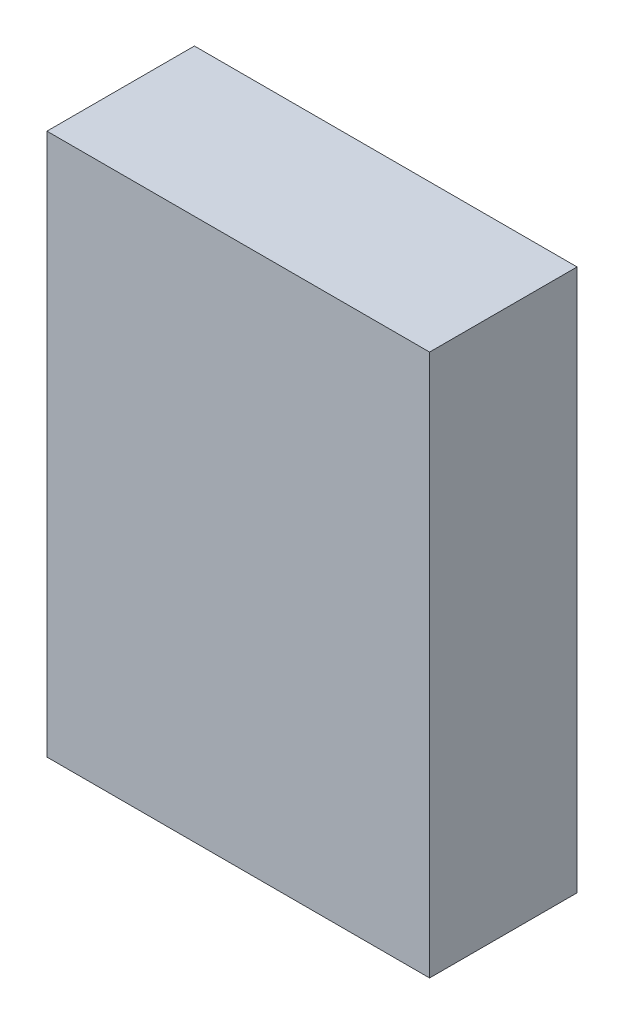
ISO-10303-21;
HEADER;
FILE_DESCRIPTION(('STEP AP214'),'2;1');
FILE_NAME('part.step','',(''),(''),'','','');
FILE_SCHEMA(('AUTOMOTIVE_DESIGN { 1 0 10303 214 1 1 1 1 }'));
ENDSEC;
DATA;
#1=APPLICATION_CONTEXT('core data for automotive mechanical design processes');
#2=APPLICATION_PROTOCOL_DEFINITION('international standard','automotive_design',2000,#1);
#3=PRODUCT_CONTEXT('',#1,'mechanical');
#4=PRODUCT('Part','Part','',(#3));
#5=PRODUCT_RELATED_PRODUCT_CATEGORY('part','',(#4));
#6=PRODUCT_DEFINITION_FORMATION('','',#4);
#7=PRODUCT_DEFINITION_CONTEXT('part definition',#1,'design');
#8=PRODUCT_DEFINITION('design','',#6,#7);
#9=PRODUCT_DEFINITION_SHAPE('','',#8);
#10=(LENGTH_UNIT() NAMED_UNIT(*) SI_UNIT(.MILLI.,.METRE.));
#11=(NAMED_UNIT(*) PLANE_ANGLE_UNIT() SI_UNIT($,.RADIAN.));
#12=(NAMED_UNIT(*) SI_UNIT($,.STERADIAN.) SOLID_ANGLE_UNIT());
#13=UNCERTAINTY_MEASURE_WITH_UNIT(LENGTH_MEASURE(1.E-05),#10,'distance_accuracy_value','');
#14=(GEOMETRIC_REPRESENTATION_CONTEXT(3) GLOBAL_UNCERTAINTY_ASSIGNED_CONTEXT((#13)) GLOBAL_UNIT_ASSIGNED_CONTEXT((#10,
#11,#12)) REPRESENTATION_CONTEXT('',''));
#15=CARTESIAN_POINT('',(0.,0.,0.));
#16=DIRECTION('',(0.,0.,1.));
#17=DIRECTION('',(1.,0.,0.));
#18=AXIS2_PLACEMENT_3D('',#15,#16,#17);
#19=CARTESIAN_POINT('',(0.,0.,0.));
#20=DIRECTION('',(0.,0.,1.));
#21=DIRECTION('',(1.,0.,0.));
#22=AXIS2_PLACEMENT_3D('',#19,#20,#21);
#23=PLANE('',#22);
#24=DIRECTION('',(0.,-1.,0.));
#25=VECTOR('',#24,1.);
#26=CARTESIAN_POINT('',(-24.,-34.,0.));
#27=LINE('',#26,#25);
#28=CARTESIAN_POINT('',(-24.,34.,0.));
#29=VERTEX_POINT('',#28);
#30=CARTESIAN_POINT('',(-24.,-34.,0.));
#31=VERTEX_POINT('',#30);
#32=EDGE_CURVE('E118',#29,#31,#27,.T.);
#33=ORIENTED_EDGE('',*,*,#32,.F.);
#34=DIRECTION('',(-1.,0.,0.));
#35=VECTOR('',#34,1.);
#36=CARTESIAN_POINT('',(24.,34.,0.));
#37=LINE('',#36,#35);
#38=CARTESIAN_POINT('',(24.,34.,0.));
#39=VERTEX_POINT('',#38);
#40=EDGE_CURVE('E131',#39,#29,#37,.T.);
#41=ORIENTED_EDGE('',*,*,#40,.F.);
#42=DIRECTION('',(0.,1.,0.));
#43=VECTOR('',#42,1.);
#44=CARTESIAN_POINT('',(24.,-34.,0.));
#45=LINE('',#44,#43);
#46=CARTESIAN_POINT('',(24.,-34.,0.));
#47=VERTEX_POINT('',#46);
#48=EDGE_CURVE('E139',#47,#39,#45,.T.);
#49=ORIENTED_EDGE('',*,*,#48,.F.);
#50=DIRECTION('',(1.,0.,0.));
#51=VECTOR('',#50,1.);
#52=CARTESIAN_POINT('',(24.,-34.,0.));
#53=LINE('',#52,#51);
#54=EDGE_CURVE('E121',#31,#47,#53,.T.);
#55=ORIENTED_EDGE('',*,*,#54,.F.);
#56=EDGE_LOOP('',(#33,#41,#49,#55));
#57=FACE_BOUND('',#56,.T.);
#58=DIRECTION('',(0.,-1.,0.));
#59=VECTOR('',#58,1.);
#60=CARTESIAN_POINT('',(-9.99999999999998,31.,0.));
#61=LINE('',#60,#59);
#62=CARTESIAN_POINT('',(-9.99999999999998,31.,0.));
#63=VERTEX_POINT('',#62);
#64=CARTESIAN_POINT('',(-9.99999999999998,27.,0.));
#65=VERTEX_POINT('',#64);
#66=EDGE_CURVE('E117',#63,#65,#61,.T.);
#67=ORIENTED_EDGE('',*,*,#66,.F.);
#68=DIRECTION('',(1.,0.,0.));
#69=VECTOR('',#68,1.);
#70=CARTESIAN_POINT('',(-18.,31.,0.));
#71=LINE('',#70,#69);
#72=CARTESIAN_POINT('',(-18.,31.,0.));
#73=VERTEX_POINT('',#72);
#74=EDGE_CURVE('E114',#73,#63,#71,.T.);
#75=ORIENTED_EDGE('',*,*,#74,.F.);
#76=DIRECTION('',(0.,1.,0.));
#77=VECTOR('',#76,1.);
#78=CARTESIAN_POINT('',(-18.,31.,0.));
#79=LINE('',#78,#77);
#80=CARTESIAN_POINT('',(-18.,27.,0.));
#81=VERTEX_POINT('',#80);
#82=EDGE_CURVE('E52',#81,#73,#79,.T.);
#83=ORIENTED_EDGE('',*,*,#82,.F.);
#84=DIRECTION('',(-1.,0.,0.));
#85=VECTOR('',#84,1.);
#86=CARTESIAN_POINT('',(-18.,27.,0.));
#87=LINE('',#86,#85);
#88=EDGE_CURVE('E47',#65,#81,#87,.T.);
#89=ORIENTED_EDGE('',*,*,#88,.F.);
#90=EDGE_LOOP('',(#67,#75,#83,#89));
#91=FACE_BOUND('',#90,.T.);
#92=ADVANCED_FACE('F32',(#57,#91),#23,.F.);
#93=CARTESIAN_POINT('',(-24.,-34.,18.5));
#94=DIRECTION('',(1.,0.,0.));
#95=DIRECTION('',(0.,0.,-1.));
#96=AXIS2_PLACEMENT_3D('',#93,#94,#95);
#97=PLANE('',#96);
#98=ORIENTED_EDGE('',*,*,#32,.T.);
#99=DIRECTION('',(0.,0.,-1.));
#100=VECTOR('',#99,1.);
#101=CARTESIAN_POINT('',(-24.,-34.,18.5));
#102=LINE('',#101,#100);
#103=CARTESIAN_POINT('',(-24.,-34.,18.5));
#104=VERTEX_POINT('',#103);
#105=EDGE_CURVE('E11',#104,#31,#102,.T.);
#106=ORIENTED_EDGE('',*,*,#105,.F.);
#107=DIRECTION('',(0.,-1.,0.));
#108=VECTOR('',#107,1.);
#109=CARTESIAN_POINT('',(-24.,-34.,18.5));
#110=LINE('',#109,#108);
#111=CARTESIAN_POINT('',(-24.,34.,18.5));
#112=VERTEX_POINT('',#111);
#113=EDGE_CURVE('E127',#112,#104,#110,.T.);
#114=ORIENTED_EDGE('',*,*,#113,.F.);
#115=DIRECTION('',(0.,0.,-1.));
#116=VECTOR('',#115,1.);
#117=CARTESIAN_POINT('',(-24.,34.,18.5));
#118=LINE('',#117,#116);
#119=EDGE_CURVE('E136',#112,#29,#118,.T.);
#120=ORIENTED_EDGE('',*,*,#119,.T.);
#121=EDGE_LOOP('',(#98,#106,#114,#120));
#122=FACE_BOUND('',#121,.T.);
#123=ADVANCED_FACE('F34',(#122),#97,.F.);
#124=CARTESIAN_POINT('',(24.,-34.,18.5));
#125=DIRECTION('',(0.,1.,0.));
#126=DIRECTION('',(0.,0.,1.));
#127=AXIS2_PLACEMENT_3D('',#124,#125,#126);
#128=PLANE('',#127);
#129=ORIENTED_EDGE('',*,*,#54,.T.);
#130=DIRECTION('',(0.,0.,-1.));
#131=VECTOR('',#130,1.);
#132=CARTESIAN_POINT('',(24.,-34.,18.5));
#133=LINE('',#132,#131);
#134=CARTESIAN_POINT('',(24.,-34.,18.5));
#135=VERTEX_POINT('',#134);
#136=EDGE_CURVE('E40',#135,#47,#133,.T.);
#137=ORIENTED_EDGE('',*,*,#136,.F.);
#138=DIRECTION('',(1.,0.,0.));
#139=VECTOR('',#138,1.);
#140=CARTESIAN_POINT('',(24.,-34.,18.5));
#141=LINE('',#140,#139);
#142=EDGE_CURVE('E130',#104,#135,#141,.T.);
#143=ORIENTED_EDGE('',*,*,#142,.F.);
#144=ORIENTED_EDGE('',*,*,#105,.T.);
#145=EDGE_LOOP('',(#129,#137,#143,#144));
#146=FACE_BOUND('',#145,.T.);
#147=ADVANCED_FACE('F166',(#146),#128,.F.);
#148=CARTESIAN_POINT('',(24.,-34.,18.5));
#149=DIRECTION('',(-1.,0.,0.));
#150=DIRECTION('',(0.,0.,1.));
#151=AXIS2_PLACEMENT_3D('',#148,#149,#150);
#152=PLANE('',#151);
#153=ORIENTED_EDGE('',*,*,#48,.T.);
#154=DIRECTION('',(0.,0.,-1.));
#155=VECTOR('',#154,1.);
#156=CARTESIAN_POINT('',(24.,34.,18.5));
#157=LINE('',#156,#155);
#158=CARTESIAN_POINT('',(24.,34.,18.5));
#159=VERTEX_POINT('',#158);
#160=EDGE_CURVE('E144',#159,#39,#157,.T.);
#161=ORIENTED_EDGE('',*,*,#160,.F.);
#162=DIRECTION('',(0.,1.,0.));
#163=VECTOR('',#162,1.);
#164=CARTESIAN_POINT('',(24.,-34.,18.5));
#165=LINE('',#164,#163);
#166=EDGE_CURVE('E133',#135,#159,#165,.T.);
#167=ORIENTED_EDGE('',*,*,#166,.F.);
#168=ORIENTED_EDGE('',*,*,#136,.T.);
#169=EDGE_LOOP('',(#153,#161,#167,#168));
#170=FACE_BOUND('',#169,.T.);
#171=ADVANCED_FACE('F151',(#170),#152,.F.);
#172=CARTESIAN_POINT('',(24.,34.,18.5));
#173=DIRECTION('',(0.,-1.,0.));
#174=DIRECTION('',(1.,0.,0.));
#175=AXIS2_PLACEMENT_3D('',#172,#173,#174);
#176=PLANE('',#175);
#177=ORIENTED_EDGE('',*,*,#40,.T.);
#178=ORIENTED_EDGE('',*,*,#119,.F.);
#179=DIRECTION('',(-1.,0.,0.));
#180=VECTOR('',#179,1.);
#181=CARTESIAN_POINT('',(24.,34.,18.5));
#182=LINE('',#181,#180);
#183=EDGE_CURVE('E135',#159,#112,#182,.T.);
#184=ORIENTED_EDGE('',*,*,#183,.F.);
#185=ORIENTED_EDGE('',*,*,#160,.T.);
#186=EDGE_LOOP('',(#177,#178,#184,#185));
#187=FACE_BOUND('',#186,.T.);
#188=ADVANCED_FACE('F159',(#187),#176,.F.);
#189=CARTESIAN_POINT('',(0.,0.,18.5));
#190=DIRECTION('',(0.,0.,1.));
#191=DIRECTION('',(1.,0.,0.));
#192=AXIS2_PLACEMENT_3D('',#189,#190,#191);
#193=PLANE('',#192);
#194=ORIENTED_EDGE('',*,*,#113,.T.);
#195=ORIENTED_EDGE('',*,*,#142,.T.);
#196=ORIENTED_EDGE('',*,*,#166,.T.);
#197=ORIENTED_EDGE('',*,*,#183,.T.);
#198=EDGE_LOOP('',(#194,#195,#196,#197));
#199=FACE_BOUND('',#198,.T.);
#200=ADVANCED_FACE('F165',(#199),#193,.T.);
#201=CARTESIAN_POINT('',(-9.99999999999998,31.,-2.));
#202=DIRECTION('',(-1.,0.,0.));
#203=DIRECTION('',(0.,0.,1.));
#204=AXIS2_PLACEMENT_3D('',#201,#202,#203);
#205=PLANE('',#204);
#206=ORIENTED_EDGE('',*,*,#66,.T.);
#207=DIRECTION('',(0.,0.,1.));
#208=VECTOR('',#207,1.);
#209=CARTESIAN_POINT('',(-9.99999999999998,27.,-2.));
#210=LINE('',#209,#208);
#211=CARTESIAN_POINT('',(-9.99999999999998,27.,-2.));
#212=VERTEX_POINT('',#211);
#213=EDGE_CURVE('E98',#212,#65,#210,.T.);
#214=ORIENTED_EDGE('',*,*,#213,.F.);
#215=DIRECTION('',(0.,-1.,0.));
#216=VECTOR('',#215,1.);
#217=CARTESIAN_POINT('',(-9.99999999999998,31.,-2.));
#218=LINE('',#217,#216);
#219=CARTESIAN_POINT('',(-9.99999999999998,31.,-2.));
#220=VERTEX_POINT('',#219);
#221=EDGE_CURVE('E105',#220,#212,#218,.T.);
#222=ORIENTED_EDGE('',*,*,#221,.F.);
#223=DIRECTION('',(0.,0.,1.));
#224=VECTOR('',#223,1.);
#225=CARTESIAN_POINT('',(-9.99999999999998,31.,-2.));
#226=LINE('',#225,#224);
#227=EDGE_CURVE('E259',#220,#63,#226,.T.);
#228=ORIENTED_EDGE('',*,*,#227,.T.);
#229=EDGE_LOOP('',(#206,#214,#222,#228));
#230=FACE_BOUND('',#229,.T.);
#231=ADVANCED_FACE('F116',(#230),#205,.F.);
#232=CARTESIAN_POINT('',(-18.,27.,-2.));
#233=DIRECTION('',(0.,1.,0.));
#234=DIRECTION('',(0.,0.,1.));
#235=AXIS2_PLACEMENT_3D('',#232,#233,#234);
#236=PLANE('',#235);
#237=ORIENTED_EDGE('',*,*,#88,.T.);
#238=DIRECTION('',(0.,0.,1.));
#239=VECTOR('',#238,1.);
#240=CARTESIAN_POINT('',(-18.,27.,-2.));
#241=LINE('',#240,#239);
#242=CARTESIAN_POINT('',(-18.,27.,-2.));
#243=VERTEX_POINT('',#242);
#244=EDGE_CURVE('E101',#243,#81,#241,.T.);
#245=ORIENTED_EDGE('',*,*,#244,.F.);
#246=DIRECTION('',(-1.,0.,0.));
#247=VECTOR('',#246,1.);
#248=CARTESIAN_POINT('',(-18.,27.,-2.));
#249=LINE('',#248,#247);
#250=EDGE_CURVE('E94',#212,#243,#249,.T.);
#251=ORIENTED_EDGE('',*,*,#250,.F.);
#252=ORIENTED_EDGE('',*,*,#213,.T.);
#253=EDGE_LOOP('',(#237,#245,#251,#252));
#254=FACE_BOUND('',#253,.T.);
#255=ADVANCED_FACE('F96',(#254),#236,.F.);
#256=CARTESIAN_POINT('',(-18.,31.,-2.));
#257=DIRECTION('',(1.,0.,0.));
#258=DIRECTION('',(0.,0.,-1.));
#259=AXIS2_PLACEMENT_3D('',#256,#257,#258);
#260=PLANE('',#259);
#261=ORIENTED_EDGE('',*,*,#82,.T.);
#262=DIRECTION('',(0.,0.,1.));
#263=VECTOR('',#262,1.);
#264=CARTESIAN_POINT('',(-18.,31.,-2.));
#265=LINE('',#264,#263);
#266=CARTESIAN_POINT('',(-18.,31.,-2.));
#267=VERTEX_POINT('',#266);
#268=EDGE_CURVE('E123',#267,#73,#265,.T.);
#269=ORIENTED_EDGE('',*,*,#268,.F.);
#270=DIRECTION('',(0.,1.,0.));
#271=VECTOR('',#270,1.);
#272=CARTESIAN_POINT('',(-18.,31.,-2.));
#273=LINE('',#272,#271);
#274=EDGE_CURVE('E104',#243,#267,#273,.T.);
#275=ORIENTED_EDGE('',*,*,#274,.F.);
#276=ORIENTED_EDGE('',*,*,#244,.T.);
#277=EDGE_LOOP('',(#261,#269,#275,#276));
#278=FACE_BOUND('',#277,.T.);
#279=ADVANCED_FACE('F190',(#278),#260,.F.);
#280=CARTESIAN_POINT('',(-18.,31.,-2.));
#281=DIRECTION('',(0.,-1.,0.));
#282=DIRECTION('',(0.,0.,-1.));
#283=AXIS2_PLACEMENT_3D('',#280,#281,#282);
#284=PLANE('',#283);
#285=ORIENTED_EDGE('',*,*,#74,.T.);
#286=ORIENTED_EDGE('',*,*,#227,.F.);
#287=DIRECTION('',(1.,0.,0.));
#288=VECTOR('',#287,1.);
#289=CARTESIAN_POINT('',(-18.,31.,-2.));
#290=LINE('',#289,#288);
#291=EDGE_CURVE('E110',#267,#220,#290,.T.);
#292=ORIENTED_EDGE('',*,*,#291,.F.);
#293=ORIENTED_EDGE('',*,*,#268,.T.);
#294=EDGE_LOOP('',(#285,#286,#292,#293));
#295=FACE_BOUND('',#294,.T.);
#296=ADVANCED_FACE('F195',(#295),#284,.F.);
#297=CARTESIAN_POINT('',(0.,0.,-2.));
#298=DIRECTION('',(0.,0.,1.));
#299=DIRECTION('',(1.,0.,0.));
#300=AXIS2_PLACEMENT_3D('',#297,#298,#299);
#301=PLANE('',#300);
#302=ORIENTED_EDGE('',*,*,#221,.T.);
#303=ORIENTED_EDGE('',*,*,#250,.T.);
#304=ORIENTED_EDGE('',*,*,#274,.T.);
#305=ORIENTED_EDGE('',*,*,#291,.T.);
#306=EDGE_LOOP('',(#302,#303,#304,#305));
#307=FACE_BOUND('',#306,.T.);
#308=ADVANCED_FACE('F108',(#307),#301,.F.);
#309=CLOSED_SHELL('',(#92,#123,#147,#171,#188,#200,#231,#255,#279,#296,#308));
#310=MANIFOLD_SOLID_BREP('B2',#309);
#311=ADVANCED_BREP_SHAPE_REPRESENTATION('',(#18,#310),#14);
#312=SHAPE_DEFINITION_REPRESENTATION(#9,#311);
ENDSEC;
END-ISO-10303-21;
